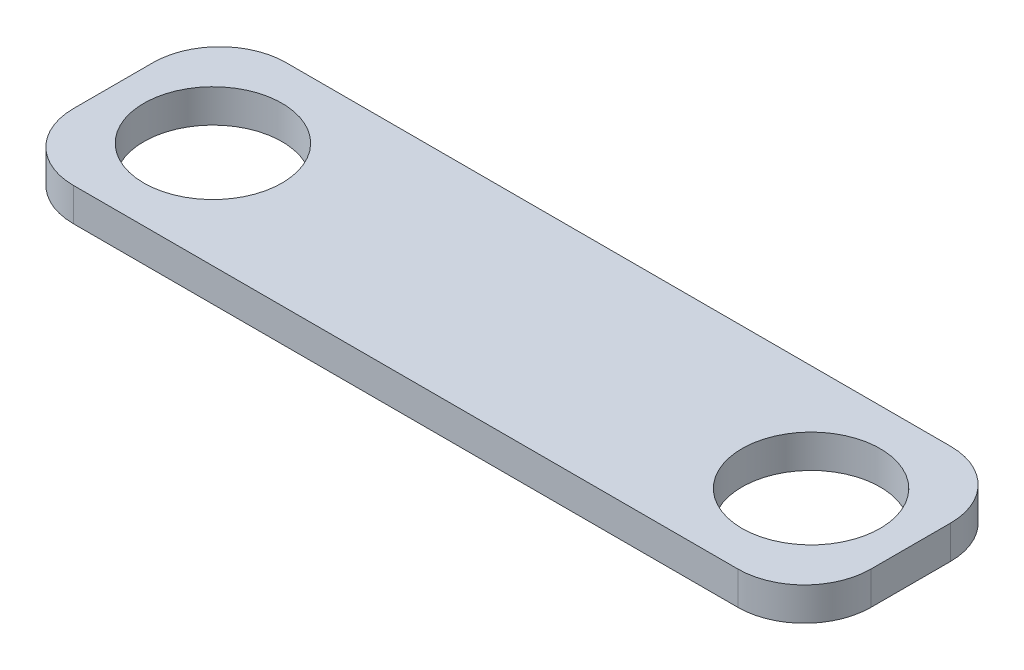
ISO-10303-21;
HEADER;
FILE_DESCRIPTION(('STEP AP214'),'2;1');
FILE_NAME('part.step','',(''),(''),'','','');
FILE_SCHEMA(('AUTOMOTIVE_DESIGN { 1 0 10303 214 1 1 1 1 }'));
ENDSEC;
DATA;
#1=APPLICATION_CONTEXT('core data for automotive mechanical design processes');
#2=APPLICATION_PROTOCOL_DEFINITION('international standard','automotive_design',2000,#1);
#3=PRODUCT_CONTEXT('',#1,'mechanical');
#4=PRODUCT('Part','Part','',(#3));
#5=PRODUCT_RELATED_PRODUCT_CATEGORY('part','',(#4));
#6=PRODUCT_DEFINITION_FORMATION('','',#4);
#7=PRODUCT_DEFINITION_CONTEXT('part definition',#1,'design');
#8=PRODUCT_DEFINITION('design','',#6,#7);
#9=PRODUCT_DEFINITION_SHAPE('','',#8);
#10=(LENGTH_UNIT() NAMED_UNIT(*) SI_UNIT(.MILLI.,.METRE.));
#11=(NAMED_UNIT(*) PLANE_ANGLE_UNIT() SI_UNIT($,.RADIAN.));
#12=(NAMED_UNIT(*) SI_UNIT($,.STERADIAN.) SOLID_ANGLE_UNIT());
#13=UNCERTAINTY_MEASURE_WITH_UNIT(LENGTH_MEASURE(1.E-05),#10,'distance_accuracy_value','');
#14=(GEOMETRIC_REPRESENTATION_CONTEXT(3) GLOBAL_UNCERTAINTY_ASSIGNED_CONTEXT((#13)) GLOBAL_UNIT_ASSIGNED_CONTEXT((#10,
#11,#12)) REPRESENTATION_CONTEXT('',''));
#15=CARTESIAN_POINT('',(0.,0.,0.));
#16=DIRECTION('',(0.,0.,1.));
#17=DIRECTION('',(1.,0.,0.));
#18=AXIS2_PLACEMENT_3D('',#15,#16,#17);
#19=CARTESIAN_POINT('',(25.,2.5,3.));
#20=DIRECTION('',(0.,1.,0.));
#21=DIRECTION('',(0.,0.,1.));
#22=AXIS2_PLACEMENT_3D('',#19,#20,#21);
#23=PLANE('',#22);
#24=CARTESIAN_POINT('',(-22.5,2.5,0.));
#25=DIRECTION('',(0.,1.,0.));
#26=DIRECTION('',(0.,0.,1.));
#27=AXIS2_PLACEMENT_3D('',#24,#25,#26);
#28=CIRCLE('',#27,5.2);
#29=CARTESIAN_POINT('',(-22.5,2.5,5.2));
#30=VERTEX_POINT('',#29);
#31=EDGE_CURVE('E137',#30,#30,#28,.T.);
#32=ORIENTED_EDGE('',*,*,#31,.F.);
#33=EDGE_LOOP('',(#32));
#34=FACE_BOUND('',#33,.T.);
#35=CARTESIAN_POINT('',(25.,2.5,3.));
#36=DIRECTION('',(0.,1.,0.));
#37=DIRECTION('',(0.,0.,1.));
#38=AXIS2_PLACEMENT_3D('',#35,#36,#37);
#39=CIRCLE('',#38,5.);
#40=CARTESIAN_POINT('',(25.,2.5,8.));
#41=VERTEX_POINT('',#40);
#42=CARTESIAN_POINT('',(30.,2.5,2.99999999999996));
#43=VERTEX_POINT('',#42);
#44=EDGE_CURVE('E148',#41,#43,#39,.T.);
#45=ORIENTED_EDGE('',*,*,#44,.T.);
#46=DIRECTION('',(0.,0.,-1.));
#47=VECTOR('',#46,1.);
#48=CARTESIAN_POINT('',(30.,2.5,2.99999999999996));
#49=LINE('',#48,#47);
#50=CARTESIAN_POINT('',(30.,2.5,-2.99999999999997));
#51=VERTEX_POINT('',#50);
#52=EDGE_CURVE('E96',#43,#51,#49,.T.);
#53=ORIENTED_EDGE('',*,*,#52,.T.);
#54=CARTESIAN_POINT('',(25.,2.5,-3.));
#55=DIRECTION('',(0.,1.,0.));
#56=DIRECTION('',(0.,0.,1.));
#57=AXIS2_PLACEMENT_3D('',#54,#55,#56);
#58=CIRCLE('',#57,5.);
#59=CARTESIAN_POINT('',(25.,2.5,-8.));
#60=VERTEX_POINT('',#59);
#61=EDGE_CURVE('E163',#51,#60,#58,.T.);
#62=ORIENTED_EDGE('',*,*,#61,.T.);
#63=DIRECTION('',(-1.,0.,0.));
#64=VECTOR('',#63,1.);
#65=CARTESIAN_POINT('',(25.,2.5,-8.));
#66=LINE('',#65,#64);
#67=CARTESIAN_POINT('',(-25.,2.5,-8.));
#68=VERTEX_POINT('',#67);
#69=EDGE_CURVE('E176',#60,#68,#66,.T.);
#70=ORIENTED_EDGE('',*,*,#69,.T.);
#71=CARTESIAN_POINT('',(-25.,2.5,-3.));
#72=DIRECTION('',(0.,1.,0.));
#73=DIRECTION('',(0.,0.,1.));
#74=AXIS2_PLACEMENT_3D('',#71,#72,#73);
#75=CIRCLE('',#74,5.);
#76=CARTESIAN_POINT('',(-30.,2.5,-2.99999999999996));
#77=VERTEX_POINT('',#76);
#78=EDGE_CURVE('E115',#68,#77,#75,.T.);
#79=ORIENTED_EDGE('',*,*,#78,.T.);
#80=DIRECTION('',(0.,0.,1.));
#81=VECTOR('',#80,1.);
#82=CARTESIAN_POINT('',(-30.,2.5,2.99999999999997));
#83=LINE('',#82,#81);
#84=CARTESIAN_POINT('',(-30.,2.5,2.99999999999997));
#85=VERTEX_POINT('',#84);
#86=EDGE_CURVE('E109',#77,#85,#83,.T.);
#87=ORIENTED_EDGE('',*,*,#86,.T.);
#88=CARTESIAN_POINT('',(-25.,2.5,3.00000000000001));
#89=DIRECTION('',(0.,1.,0.));
#90=DIRECTION('',(0.,0.,-1.));
#91=AXIS2_PLACEMENT_3D('',#88,#89,#90);
#92=CIRCLE('',#91,5.);
#93=CARTESIAN_POINT('',(-25.,2.5,8.00000000000001));
#94=VERTEX_POINT('',#93);
#95=EDGE_CURVE('E113',#85,#94,#92,.T.);
#96=ORIENTED_EDGE('',*,*,#95,.T.);
#97=DIRECTION('',(1.,0.,0.));
#98=VECTOR('',#97,1.);
#99=CARTESIAN_POINT('',(25.,2.5,8.));
#100=LINE('',#99,#98);
#101=EDGE_CURVE('E53',#94,#41,#100,.T.);
#102=ORIENTED_EDGE('',*,*,#101,.T.);
#103=EDGE_LOOP('',(#45,#53,#62,#70,#79,#87,#96,#102));
#104=FACE_BOUND('',#103,.T.);
#105=CARTESIAN_POINT('',(22.5,2.5,0.));
#106=DIRECTION('',(0.,1.,0.));
#107=DIRECTION('',(0.,0.,1.));
#108=AXIS2_PLACEMENT_3D('',#105,#106,#107);
#109=CIRCLE('',#108,5.2);
#110=CARTESIAN_POINT('',(22.5,2.5,5.19999999999999));
#111=VERTEX_POINT('',#110);
#112=EDGE_CURVE('E185',#111,#111,#109,.T.);
#113=ORIENTED_EDGE('',*,*,#112,.F.);
#114=EDGE_LOOP('',(#113));
#115=FACE_BOUND('',#114,.T.);
#116=ADVANCED_FACE('F36',(#34,#104,#115),#23,.T.);
#117=CARTESIAN_POINT('',(25.,0.,3.));
#118=DIRECTION('',(0.,1.,0.));
#119=DIRECTION('',(0.,0.,1.));
#120=AXIS2_PLACEMENT_3D('',#117,#118,#119);
#121=PLANE('',#120);
#122=CARTESIAN_POINT('',(25.,0.,3.));
#123=DIRECTION('',(0.,1.,0.));
#124=DIRECTION('',(0.,0.,1.));
#125=AXIS2_PLACEMENT_3D('',#122,#123,#124);
#126=CIRCLE('',#125,5.);
#127=CARTESIAN_POINT('',(25.,0.,8.));
#128=VERTEX_POINT('',#127);
#129=CARTESIAN_POINT('',(30.,0.,2.99999999999996));
#130=VERTEX_POINT('',#129);
#131=EDGE_CURVE('E133',#128,#130,#126,.T.);
#132=ORIENTED_EDGE('',*,*,#131,.F.);
#133=DIRECTION('',(1.,0.,0.));
#134=VECTOR('',#133,1.);
#135=CARTESIAN_POINT('',(25.,0.,8.));
#136=LINE('',#135,#134);
#137=CARTESIAN_POINT('',(-25.,0.,8.00000000000001));
#138=VERTEX_POINT('',#137);
#139=EDGE_CURVE('E88',#138,#128,#136,.T.);
#140=ORIENTED_EDGE('',*,*,#139,.F.);
#141=CARTESIAN_POINT('',(-25.,0.,3.00000000000001));
#142=DIRECTION('',(0.,1.,0.));
#143=DIRECTION('',(0.,0.,-1.));
#144=AXIS2_PLACEMENT_3D('',#141,#142,#143);
#145=CIRCLE('',#144,5.);
#146=CARTESIAN_POINT('',(-30.,0.,2.99999999999997));
#147=VERTEX_POINT('',#146);
#148=EDGE_CURVE('E82',#147,#138,#145,.T.);
#149=ORIENTED_EDGE('',*,*,#148,.F.);
#150=DIRECTION('',(0.,0.,1.));
#151=VECTOR('',#150,1.);
#152=CARTESIAN_POINT('',(-30.,0.,2.99999999999997));
#153=LINE('',#152,#151);
#154=CARTESIAN_POINT('',(-30.,0.,-2.99999999999996));
#155=VERTEX_POINT('',#154);
#156=EDGE_CURVE('E123',#155,#147,#153,.T.);
#157=ORIENTED_EDGE('',*,*,#156,.F.);
#158=CARTESIAN_POINT('',(-25.,0.,-3.));
#159=DIRECTION('',(0.,1.,0.));
#160=DIRECTION('',(0.,0.,1.));
#161=AXIS2_PLACEMENT_3D('',#158,#159,#160);
#162=CIRCLE('',#161,5.);
#163=CARTESIAN_POINT('',(-25.,0.,-8.));
#164=VERTEX_POINT('',#163);
#165=EDGE_CURVE('E143',#164,#155,#162,.T.);
#166=ORIENTED_EDGE('',*,*,#165,.F.);
#167=DIRECTION('',(-1.,0.,0.));
#168=VECTOR('',#167,1.);
#169=CARTESIAN_POINT('',(25.,0.,-8.));
#170=LINE('',#169,#168);
#171=CARTESIAN_POINT('',(25.,0.,-8.));
#172=VERTEX_POINT('',#171);
#173=EDGE_CURVE('E141',#172,#164,#170,.T.);
#174=ORIENTED_EDGE('',*,*,#173,.F.);
#175=CARTESIAN_POINT('',(25.,0.,-3.));
#176=DIRECTION('',(0.,1.,0.));
#177=DIRECTION('',(0.,0.,1.));
#178=AXIS2_PLACEMENT_3D('',#175,#176,#177);
#179=CIRCLE('',#178,5.);
#180=CARTESIAN_POINT('',(30.,0.,-2.99999999999997));
#181=VERTEX_POINT('',#180);
#182=EDGE_CURVE('E139',#181,#172,#179,.T.);
#183=ORIENTED_EDGE('',*,*,#182,.F.);
#184=DIRECTION('',(0.,0.,-1.));
#185=VECTOR('',#184,1.);
#186=CARTESIAN_POINT('',(30.,0.,2.99999999999996));
#187=LINE('',#186,#185);
#188=EDGE_CURVE('E136',#130,#181,#187,.T.);
#189=ORIENTED_EDGE('',*,*,#188,.F.);
#190=EDGE_LOOP('',(#132,#140,#149,#157,#166,#174,#183,#189));
#191=FACE_BOUND('',#190,.T.);
#192=CARTESIAN_POINT('',(-22.5,0.,0.));
#193=DIRECTION('',(0.,1.,0.));
#194=DIRECTION('',(0.,0.,1.));
#195=AXIS2_PLACEMENT_3D('',#192,#193,#194);
#196=CIRCLE('',#195,5.2);
#197=CARTESIAN_POINT('',(-22.5,0.,5.2));
#198=VERTEX_POINT('',#197);
#199=EDGE_CURVE('E182',#198,#198,#196,.T.);
#200=ORIENTED_EDGE('',*,*,#199,.T.);
#201=EDGE_LOOP('',(#200));
#202=FACE_BOUND('',#201,.T.);
#203=CARTESIAN_POINT('',(22.5,0.,0.));
#204=DIRECTION('',(0.,1.,0.));
#205=DIRECTION('',(0.,0.,1.));
#206=AXIS2_PLACEMENT_3D('',#203,#204,#205);
#207=CIRCLE('',#206,5.2);
#208=CARTESIAN_POINT('',(22.5,0.,5.19999999999999));
#209=VERTEX_POINT('',#208);
#210=EDGE_CURVE('E188',#209,#209,#207,.T.);
#211=ORIENTED_EDGE('',*,*,#210,.T.);
#212=EDGE_LOOP('',(#211));
#213=FACE_BOUND('',#212,.T.);
#214=ADVANCED_FACE('F167',(#191,#202,#213),#121,.F.);
#215=CARTESIAN_POINT('',(25.,2.5,3.));
#216=DIRECTION('',(0.,-1.,0.));
#217=DIRECTION('',(0.,0.,-1.));
#218=AXIS2_PLACEMENT_3D('',#215,#216,#217);
#219=CYLINDRICAL_SURFACE('',#218,5.);
#220=ORIENTED_EDGE('',*,*,#131,.T.);
#221=DIRECTION('',(0.,-1.,0.));
#222=VECTOR('',#221,1.);
#223=CARTESIAN_POINT('',(30.,2.5,2.99999999999996));
#224=LINE('',#223,#222);
#225=EDGE_CURVE('E11',#43,#130,#224,.T.);
#226=ORIENTED_EDGE('',*,*,#225,.F.);
#227=ORIENTED_EDGE('',*,*,#44,.F.);
#228=DIRECTION('',(0.,-1.,0.));
#229=VECTOR('',#228,1.);
#230=CARTESIAN_POINT('',(25.,2.5,8.));
#231=LINE('',#230,#229);
#232=EDGE_CURVE('E129',#41,#128,#231,.T.);
#233=ORIENTED_EDGE('',*,*,#232,.T.);
#234=EDGE_LOOP('',(#220,#226,#227,#233));
#235=FACE_BOUND('',#234,.T.);
#236=ADVANCED_FACE('F38',(#235),#219,.T.);
#237=CARTESIAN_POINT('',(30.,2.5,2.99999999999996));
#238=DIRECTION('',(-1.,0.,0.));
#239=DIRECTION('',(0.,0.,1.));
#240=AXIS2_PLACEMENT_3D('',#237,#238,#239);
#241=PLANE('',#240);
#242=ORIENTED_EDGE('',*,*,#188,.T.);
#243=DIRECTION('',(0.,-1.,0.));
#244=VECTOR('',#243,1.);
#245=CARTESIAN_POINT('',(30.,2.5,-2.99999999999997));
#246=LINE('',#245,#244);
#247=EDGE_CURVE('E45',#51,#181,#246,.T.);
#248=ORIENTED_EDGE('',*,*,#247,.F.);
#249=ORIENTED_EDGE('',*,*,#52,.F.);
#250=ORIENTED_EDGE('',*,*,#225,.T.);
#251=EDGE_LOOP('',(#242,#248,#249,#250));
#252=FACE_BOUND('',#251,.T.);
#253=ADVANCED_FACE('F220',(#252),#241,.F.);
#254=CARTESIAN_POINT('',(25.,2.5,-3.));
#255=DIRECTION('',(0.,-1.,0.));
#256=DIRECTION('',(0.,0.,-1.));
#257=AXIS2_PLACEMENT_3D('',#254,#255,#256);
#258=CYLINDRICAL_SURFACE('',#257,5.);
#259=ORIENTED_EDGE('',*,*,#182,.T.);
#260=DIRECTION('',(0.,-1.,0.));
#261=VECTOR('',#260,1.);
#262=CARTESIAN_POINT('',(25.,2.5,-8.));
#263=LINE('',#262,#261);
#264=EDGE_CURVE('E155',#60,#172,#263,.T.);
#265=ORIENTED_EDGE('',*,*,#264,.F.);
#266=ORIENTED_EDGE('',*,*,#61,.F.);
#267=ORIENTED_EDGE('',*,*,#247,.T.);
#268=EDGE_LOOP('',(#259,#265,#266,#267));
#269=FACE_BOUND('',#268,.T.);
#270=ADVANCED_FACE('F161',(#269),#258,.T.);
#271=CARTESIAN_POINT('',(25.,2.5,-8.));
#272=DIRECTION('',(0.,0.,1.));
#273=DIRECTION('',(1.,0.,0.));
#274=AXIS2_PLACEMENT_3D('',#271,#272,#273);
#275=PLANE('',#274);
#276=ORIENTED_EDGE('',*,*,#173,.T.);
#277=DIRECTION('',(0.,-1.,0.));
#278=VECTOR('',#277,1.);
#279=CARTESIAN_POINT('',(-25.,2.5,-8.));
#280=LINE('',#279,#278);
#281=EDGE_CURVE('E152',#68,#164,#280,.T.);
#282=ORIENTED_EDGE('',*,*,#281,.F.);
#283=ORIENTED_EDGE('',*,*,#69,.F.);
#284=ORIENTED_EDGE('',*,*,#264,.T.);
#285=EDGE_LOOP('',(#276,#282,#283,#284));
#286=FACE_BOUND('',#285,.T.);
#287=ADVANCED_FACE('F172',(#286),#275,.F.);
#288=CARTESIAN_POINT('',(-25.,2.5,-3.));
#289=DIRECTION('',(0.,-1.,0.));
#290=DIRECTION('',(0.,0.,-1.));
#291=AXIS2_PLACEMENT_3D('',#288,#289,#290);
#292=CYLINDRICAL_SURFACE('',#291,5.);
#293=ORIENTED_EDGE('',*,*,#165,.T.);
#294=DIRECTION('',(0.,-1.,0.));
#295=VECTOR('',#294,1.);
#296=CARTESIAN_POINT('',(-30.,2.5,-2.99999999999996));
#297=LINE('',#296,#295);
#298=EDGE_CURVE('E124',#77,#155,#297,.T.);
#299=ORIENTED_EDGE('',*,*,#298,.F.);
#300=ORIENTED_EDGE('',*,*,#78,.F.);
#301=ORIENTED_EDGE('',*,*,#281,.T.);
#302=EDGE_LOOP('',(#293,#299,#300,#301));
#303=FACE_BOUND('',#302,.T.);
#304=ADVANCED_FACE('F175',(#303),#292,.T.);
#305=CARTESIAN_POINT('',(-30.,2.5,2.99999999999997));
#306=DIRECTION('',(1.,0.,0.));
#307=DIRECTION('',(0.,0.,-1.));
#308=AXIS2_PLACEMENT_3D('',#305,#306,#307);
#309=PLANE('',#308);
#310=ORIENTED_EDGE('',*,*,#156,.T.);
#311=DIRECTION('',(0.,-1.,0.));
#312=VECTOR('',#311,1.);
#313=CARTESIAN_POINT('',(-30.,2.5,2.99999999999997));
#314=LINE('',#313,#312);
#315=EDGE_CURVE('E120',#85,#147,#314,.T.);
#316=ORIENTED_EDGE('',*,*,#315,.F.);
#317=ORIENTED_EDGE('',*,*,#86,.F.);
#318=ORIENTED_EDGE('',*,*,#298,.T.);
#319=EDGE_LOOP('',(#310,#316,#317,#318));
#320=FACE_BOUND('',#319,.T.);
#321=ADVANCED_FACE('F121',(#320),#309,.F.);
#322=CARTESIAN_POINT('',(-25.,2.5,3.00000000000001));
#323=DIRECTION('',(0.,-1.,0.));
#324=DIRECTION('',(0.,0.,-1.));
#325=AXIS2_PLACEMENT_3D('',#322,#323,#324);
#326=CYLINDRICAL_SURFACE('',#325,5.);
#327=ORIENTED_EDGE('',*,*,#148,.T.);
#328=DIRECTION('',(0.,-1.,0.));
#329=VECTOR('',#328,1.);
#330=CARTESIAN_POINT('',(-25.,2.5,8.00000000000001));
#331=LINE('',#330,#329);
#332=EDGE_CURVE('E125',#94,#138,#331,.T.);
#333=ORIENTED_EDGE('',*,*,#332,.F.);
#334=ORIENTED_EDGE('',*,*,#95,.F.);
#335=ORIENTED_EDGE('',*,*,#315,.T.);
#336=EDGE_LOOP('',(#327,#333,#334,#335));
#337=FACE_BOUND('',#336,.T.);
#338=ADVANCED_FACE('F127',(#337),#326,.T.);
#339=CARTESIAN_POINT('',(25.,2.5,8.));
#340=DIRECTION('',(0.,0.,-1.));
#341=DIRECTION('',(-1.,0.,0.));
#342=AXIS2_PLACEMENT_3D('',#339,#340,#341);
#343=PLANE('',#342);
#344=ORIENTED_EDGE('',*,*,#139,.T.);
#345=ORIENTED_EDGE('',*,*,#232,.F.);
#346=ORIENTED_EDGE('',*,*,#101,.F.);
#347=ORIENTED_EDGE('',*,*,#332,.T.);
#348=EDGE_LOOP('',(#344,#345,#346,#347));
#349=FACE_BOUND('',#348,.T.);
#350=ADVANCED_FACE('F208',(#349),#343,.F.);
#351=CARTESIAN_POINT('',(-22.5,2.5,0.));
#352=DIRECTION('',(0.,-1.,0.));
#353=DIRECTION('',(0.,0.,-1.));
#354=AXIS2_PLACEMENT_3D('',#351,#352,#353);
#355=CYLINDRICAL_SURFACE('',#354,5.2);
#356=ORIENTED_EDGE('',*,*,#31,.T.);
#357=EDGE_LOOP('',(#356));
#358=FACE_BOUND('',#357,.T.);
#359=ORIENTED_EDGE('',*,*,#199,.F.);
#360=EDGE_LOOP('',(#359));
#361=FACE_BOUND('',#360,.T.);
#362=ADVANCED_FACE('F205',(#358,#361),#355,.F.);
#363=CARTESIAN_POINT('',(22.5,2.5,0.));
#364=DIRECTION('',(0.,-1.,0.));
#365=DIRECTION('',(0.,0.,-1.));
#366=AXIS2_PLACEMENT_3D('',#363,#364,#365);
#367=CYLINDRICAL_SURFACE('',#366,5.2);
#368=ORIENTED_EDGE('',*,*,#112,.T.);
#369=EDGE_LOOP('',(#368));
#370=FACE_BOUND('',#369,.T.);
#371=ORIENTED_EDGE('',*,*,#210,.F.);
#372=EDGE_LOOP('',(#371));
#373=FACE_BOUND('',#372,.T.);
#374=ADVANCED_FACE('F194',(#370,#373),#367,.F.);
#375=CLOSED_SHELL('',(#116,#214,#236,#253,#270,#287,#304,#321,#338,#350,#362,#374));
#376=MANIFOLD_SOLID_BREP('B2',#375);
#377=ADVANCED_BREP_SHAPE_REPRESENTATION('',(#18,#376),#14);
#378=SHAPE_DEFINITION_REPRESENTATION(#9,#377);
ENDSEC;
END-ISO-10303-21;
